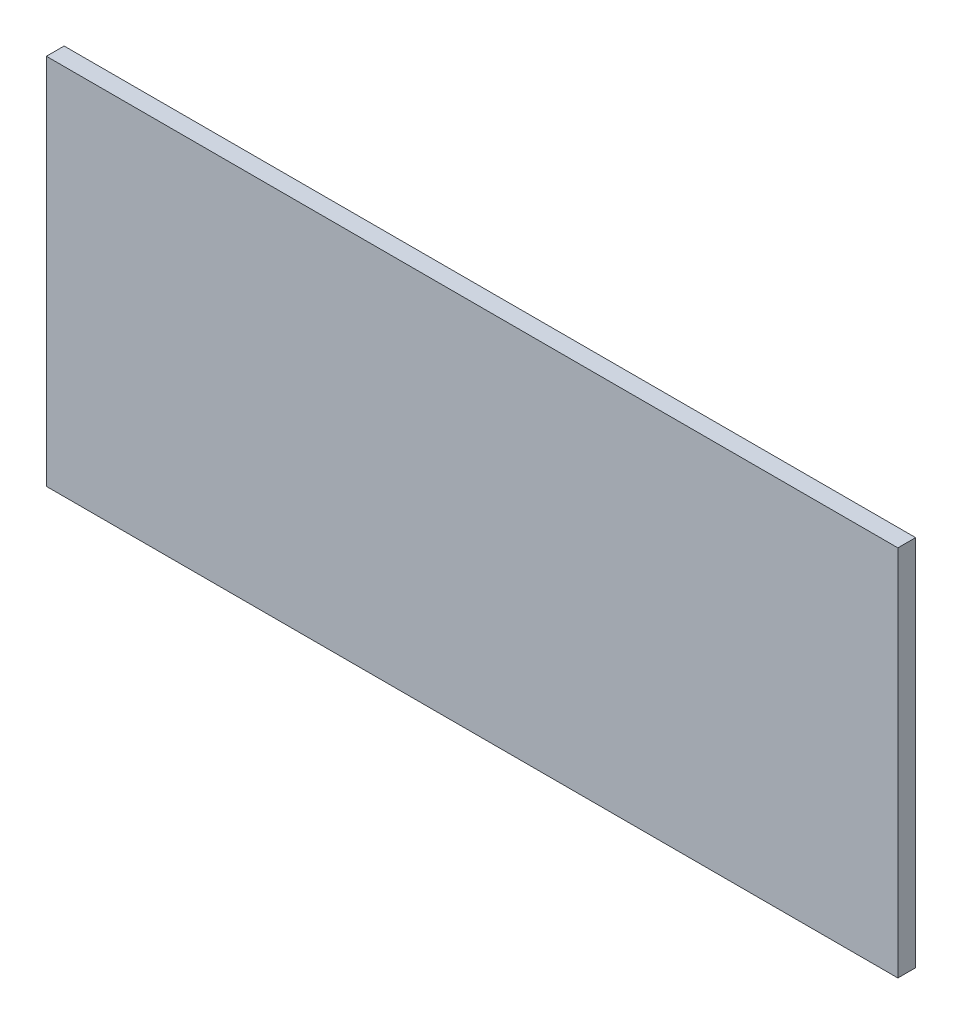
ISO-10303-21;
HEADER;
FILE_DESCRIPTION(('STEP AP214'),'2;1');
FILE_NAME('part.step','',(''),(''),'','','');
FILE_SCHEMA(('AUTOMOTIVE_DESIGN { 1 0 10303 214 1 1 1 1 }'));
ENDSEC;
DATA;
#1=APPLICATION_CONTEXT('core data for automotive mechanical design processes');
#2=APPLICATION_PROTOCOL_DEFINITION('international standard','automotive_design',2000,#1);
#3=PRODUCT_CONTEXT('',#1,'mechanical');
#4=PRODUCT('Part','Part','',(#3));
#5=PRODUCT_RELATED_PRODUCT_CATEGORY('part','',(#4));
#6=PRODUCT_DEFINITION_FORMATION('','',#4);
#7=PRODUCT_DEFINITION_CONTEXT('part definition',#1,'design');
#8=PRODUCT_DEFINITION('design','',#6,#7);
#9=PRODUCT_DEFINITION_SHAPE('','',#8);
#10=(LENGTH_UNIT() NAMED_UNIT(*) SI_UNIT(.MILLI.,.METRE.));
#11=(NAMED_UNIT(*) PLANE_ANGLE_UNIT() SI_UNIT($,.RADIAN.));
#12=(NAMED_UNIT(*) SI_UNIT($,.STERADIAN.) SOLID_ANGLE_UNIT());
#13=UNCERTAINTY_MEASURE_WITH_UNIT(LENGTH_MEASURE(1.E-05),#10,'distance_accuracy_value','');
#14=(GEOMETRIC_REPRESENTATION_CONTEXT(3) GLOBAL_UNCERTAINTY_ASSIGNED_CONTEXT((#13)) GLOBAL_UNIT_ASSIGNED_CONTEXT((#10,
#11,#12)) REPRESENTATION_CONTEXT('',''));
#15=CARTESIAN_POINT('',(0.,0.,0.));
#16=DIRECTION('',(0.,0.,1.));
#17=DIRECTION('',(1.,0.,0.));
#18=AXIS2_PLACEMENT_3D('',#15,#16,#17);
#19=CARTESIAN_POINT('',(-290.,105.,10.));
#20=DIRECTION('',(1.,0.,0.));
#21=DIRECTION('',(0.,0.,-1.));
#22=AXIS2_PLACEMENT_3D('',#19,#20,#21);
#23=PLANE('',#22);
#24=DIRECTION('',(0.,-1.,0.));
#25=VECTOR('',#24,1.);
#26=CARTESIAN_POINT('',(-290.,105.,0.));
#27=LINE('',#26,#25);
#28=CARTESIAN_POINT('',(-290.,105.,0.));
#29=VERTEX_POINT('',#28);
#30=CARTESIAN_POINT('',(-290.,-105.,0.));
#31=VERTEX_POINT('',#30);
#32=EDGE_CURVE('E96',#29,#31,#27,.T.);
#33=ORIENTED_EDGE('',*,*,#32,.T.);
#34=DIRECTION('',(0.,0.,-1.));
#35=VECTOR('',#34,1.);
#36=CARTESIAN_POINT('',(-290.,-105.,10.));
#37=LINE('',#36,#35);
#38=CARTESIAN_POINT('',(-290.,-105.,10.));
#39=VERTEX_POINT('',#38);
#40=EDGE_CURVE('E11',#39,#31,#37,.T.);
#41=ORIENTED_EDGE('',*,*,#40,.F.);
#42=DIRECTION('',(0.,-1.,0.));
#43=VECTOR('',#42,1.);
#44=CARTESIAN_POINT('',(-290.,105.,10.));
#45=LINE('',#44,#43);
#46=CARTESIAN_POINT('',(-290.,105.,10.));
#47=VERTEX_POINT('',#46);
#48=EDGE_CURVE('E84',#47,#39,#45,.T.);
#49=ORIENTED_EDGE('',*,*,#48,.F.);
#50=DIRECTION('',(0.,0.,-1.));
#51=VECTOR('',#50,1.);
#52=CARTESIAN_POINT('',(-290.,105.,10.));
#53=LINE('',#52,#51);
#54=EDGE_CURVE('E92',#47,#29,#53,.T.);
#55=ORIENTED_EDGE('',*,*,#54,.T.);
#56=EDGE_LOOP('',(#33,#41,#49,#55));
#57=FACE_BOUND('',#56,.T.);
#58=ADVANCED_FACE('F33',(#57),#23,.F.);
#59=CARTESIAN_POINT('',(-290.,-105.,10.));
#60=DIRECTION('',(0.,1.,0.));
#61=DIRECTION('',(0.,0.,1.));
#62=AXIS2_PLACEMENT_3D('',#59,#60,#61);
#63=PLANE('',#62);
#64=DIRECTION('',(1.,0.,0.));
#65=VECTOR('',#64,1.);
#66=CARTESIAN_POINT('',(-290.,-105.,0.));
#67=LINE('',#66,#65);
#68=CARTESIAN_POINT('',(190.,-105.,0.));
#69=VERTEX_POINT('',#68);
#70=EDGE_CURVE('E88',#31,#69,#67,.T.);
#71=ORIENTED_EDGE('',*,*,#70,.T.);
#72=DIRECTION('',(0.,0.,-1.));
#73=VECTOR('',#72,1.);
#74=CARTESIAN_POINT('',(190.,-105.,10.));
#75=LINE('',#74,#73);
#76=CARTESIAN_POINT('',(190.,-105.,10.));
#77=VERTEX_POINT('',#76);
#78=EDGE_CURVE('E41',#77,#69,#75,.T.);
#79=ORIENTED_EDGE('',*,*,#78,.F.);
#80=DIRECTION('',(1.,0.,0.));
#81=VECTOR('',#80,1.);
#82=CARTESIAN_POINT('',(-290.,-105.,10.));
#83=LINE('',#82,#81);
#84=EDGE_CURVE('E79',#39,#77,#83,.T.);
#85=ORIENTED_EDGE('',*,*,#84,.F.);
#86=ORIENTED_EDGE('',*,*,#40,.T.);
#87=EDGE_LOOP('',(#71,#79,#85,#86));
#88=FACE_BOUND('',#87,.T.);
#89=ADVANCED_FACE('F87',(#88),#63,.F.);
#90=CARTESIAN_POINT('',(190.,105.,10.));
#91=DIRECTION('',(-1.,0.,0.));
#92=DIRECTION('',(0.,-1.,0.));
#93=AXIS2_PLACEMENT_3D('',#90,#91,#92);
#94=PLANE('',#93);
#95=DIRECTION('',(0.,1.,0.));
#96=VECTOR('',#95,1.);
#97=CARTESIAN_POINT('',(190.,105.,0.));
#98=LINE('',#97,#96);
#99=CARTESIAN_POINT('',(190.,105.,0.));
#100=VERTEX_POINT('',#99);
#101=EDGE_CURVE('E66',#69,#100,#98,.T.);
#102=ORIENTED_EDGE('',*,*,#101,.T.);
#103=DIRECTION('',(0.,0.,-1.));
#104=VECTOR('',#103,1.);
#105=CARTESIAN_POINT('',(190.,105.,10.));
#106=LINE('',#105,#104);
#107=CARTESIAN_POINT('',(190.,105.,10.));
#108=VERTEX_POINT('',#107);
#109=EDGE_CURVE('E89',#108,#100,#106,.T.);
#110=ORIENTED_EDGE('',*,*,#109,.F.);
#111=DIRECTION('',(0.,1.,0.));
#112=VECTOR('',#111,1.);
#113=CARTESIAN_POINT('',(190.,105.,10.));
#114=LINE('',#113,#112);
#115=EDGE_CURVE('E82',#77,#108,#114,.T.);
#116=ORIENTED_EDGE('',*,*,#115,.F.);
#117=ORIENTED_EDGE('',*,*,#78,.T.);
#118=EDGE_LOOP('',(#102,#110,#116,#117));
#119=FACE_BOUND('',#118,.T.);
#120=ADVANCED_FACE('F90',(#119),#94,.F.);
#121=CARTESIAN_POINT('',(-290.,105.,10.));
#122=DIRECTION('',(0.,-1.,0.));
#123=DIRECTION('',(1.,0.,0.));
#124=AXIS2_PLACEMENT_3D('',#121,#122,#123);
#125=PLANE('',#124);
#126=DIRECTION('',(-1.,0.,0.));
#127=VECTOR('',#126,1.);
#128=CARTESIAN_POINT('',(-290.,105.,0.));
#129=LINE('',#128,#127);
#130=EDGE_CURVE('E72',#100,#29,#129,.T.);
#131=ORIENTED_EDGE('',*,*,#130,.T.);
#132=ORIENTED_EDGE('',*,*,#54,.F.);
#133=DIRECTION('',(-1.,0.,0.));
#134=VECTOR('',#133,1.);
#135=CARTESIAN_POINT('',(-290.,105.,10.));
#136=LINE('',#135,#134);
#137=EDGE_CURVE('E49',#108,#47,#136,.T.);
#138=ORIENTED_EDGE('',*,*,#137,.F.);
#139=ORIENTED_EDGE('',*,*,#109,.T.);
#140=EDGE_LOOP('',(#131,#132,#138,#139));
#141=FACE_BOUND('',#140,.T.);
#142=ADVANCED_FACE('F103',(#141),#125,.F.);
#143=CARTESIAN_POINT('',(0.,0.,10.));
#144=DIRECTION('',(0.,0.,1.));
#145=DIRECTION('',(1.,0.,0.));
#146=AXIS2_PLACEMENT_3D('',#143,#144,#145);
#147=PLANE('',#146);
#148=ORIENTED_EDGE('',*,*,#48,.T.);
#149=ORIENTED_EDGE('',*,*,#84,.T.);
#150=ORIENTED_EDGE('',*,*,#115,.T.);
#151=ORIENTED_EDGE('',*,*,#137,.T.);
#152=EDGE_LOOP('',(#148,#149,#150,#151));
#153=FACE_BOUND('',#152,.T.);
#154=ADVANCED_FACE('F80',(#153),#147,.T.);
#155=CARTESIAN_POINT('',(0.,0.,0.));
#156=DIRECTION('',(0.,0.,1.));
#157=DIRECTION('',(1.,0.,0.));
#158=AXIS2_PLACEMENT_3D('',#155,#156,#157);
#159=PLANE('',#158);
#160=ORIENTED_EDGE('',*,*,#32,.F.);
#161=ORIENTED_EDGE('',*,*,#130,.F.);
#162=ORIENTED_EDGE('',*,*,#101,.F.);
#163=ORIENTED_EDGE('',*,*,#70,.F.);
#164=EDGE_LOOP('',(#160,#161,#162,#163));
#165=FACE_BOUND('',#164,.T.);
#166=ADVANCED_FACE('F106',(#165),#159,.F.);
#167=CLOSED_SHELL('',(#58,#89,#120,#142,#154,#166));
#168=MANIFOLD_SOLID_BREP('B2',#167);
#169=ADVANCED_BREP_SHAPE_REPRESENTATION('',(#18,#168),#14);
#170=SHAPE_DEFINITION_REPRESENTATION(#9,#169);
ENDSEC;
END-ISO-10303-21;
